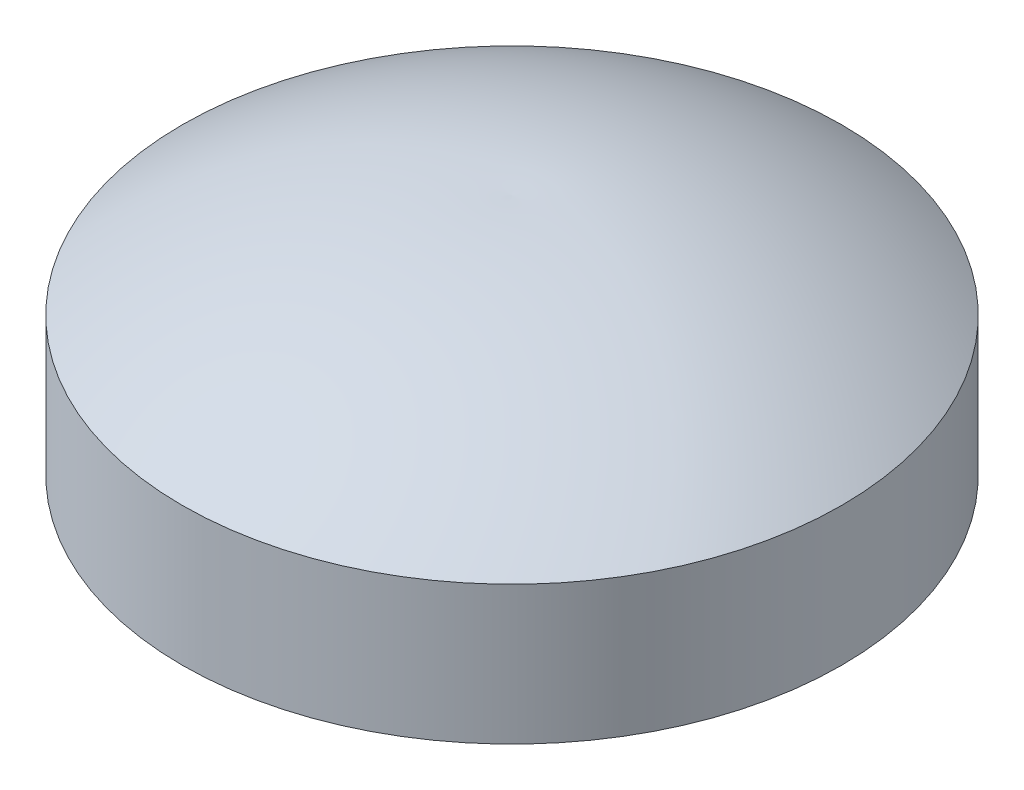
ISO-10303-21;
HEADER;
FILE_DESCRIPTION(('STEP AP214'),'2;1');
FILE_NAME('part.step','',(''),(''),'','','');
FILE_SCHEMA(('AUTOMOTIVE_DESIGN { 1 0 10303 214 1 1 1 1 }'));
ENDSEC;
DATA;
#1=APPLICATION_CONTEXT('core data for automotive mechanical design processes');
#2=APPLICATION_PROTOCOL_DEFINITION('international standard','automotive_design',2000,#1);
#3=PRODUCT_CONTEXT('',#1,'mechanical');
#4=PRODUCT('Part','Part','',(#3));
#5=PRODUCT_RELATED_PRODUCT_CATEGORY('part','',(#4));
#6=PRODUCT_DEFINITION_FORMATION('','',#4);
#7=PRODUCT_DEFINITION_CONTEXT('part definition',#1,'design');
#8=PRODUCT_DEFINITION('design','',#6,#7);
#9=PRODUCT_DEFINITION_SHAPE('','',#8);
#10=(LENGTH_UNIT() NAMED_UNIT(*) SI_UNIT(.MILLI.,.METRE.));
#11=(NAMED_UNIT(*) PLANE_ANGLE_UNIT() SI_UNIT($,.RADIAN.));
#12=(NAMED_UNIT(*) SI_UNIT($,.STERADIAN.) SOLID_ANGLE_UNIT());
#13=UNCERTAINTY_MEASURE_WITH_UNIT(LENGTH_MEASURE(1.E-05),#10,'distance_accuracy_value','');
#14=(GEOMETRIC_REPRESENTATION_CONTEXT(3) GLOBAL_UNCERTAINTY_ASSIGNED_CONTEXT((#13)) GLOBAL_UNIT_ASSIGNED_CONTEXT((#10,
#11,#12)) REPRESENTATION_CONTEXT('',''));
#15=CARTESIAN_POINT('',(0.,0.,0.));
#16=DIRECTION('',(0.,0.,1.));
#17=DIRECTION('',(1.,0.,0.));
#18=AXIS2_PLACEMENT_3D('',#15,#16,#17);
#19=CARTESIAN_POINT('',(0.,0.,0.));
#20=DIRECTION('',(0.,-1.,0.));
#21=DIRECTION('',(0.,0.,-1.));
#22=AXIS2_PLACEMENT_3D('',#19,#20,#21);
#23=PLANE('',#22);
#24=CARTESIAN_POINT('',(0.,0.,0.));
#25=DIRECTION('',(0.,-1.,0.));
#26=DIRECTION('',(0.,0.,-1.));
#27=AXIS2_PLACEMENT_3D('',#24,#25,#26);
#28=CIRCLE('',#27,4.7625);
#29=CARTESIAN_POINT('',(0.,0.,-4.7625));
#30=VERTEX_POINT('',#29);
#31=EDGE_CURVE('E11',#30,#30,#28,.T.);
#32=ORIENTED_EDGE('',*,*,#31,.T.);
#33=EDGE_LOOP('',(#32));
#34=FACE_BOUND('',#33,.T.);
#35=ADVANCED_FACE('F34',(#34),#23,.T.);
#36=CARTESIAN_POINT('',(0.,0.,0.));
#37=DIRECTION('',(0.,-1.,0.));
#38=DIRECTION('',(0.,0.,-1.));
#39=AXIS2_PLACEMENT_3D('',#36,#37,#38);
#40=CYLINDRICAL_SURFACE('',#39,4.7625);
#41=CARTESIAN_POINT('',(0.,2.,0.));
#42=DIRECTION('',(0.,-1.,0.));
#43=DIRECTION('',(0.,0.,-1.));
#44=AXIS2_PLACEMENT_3D('',#41,#42,#43);
#45=CIRCLE('',#44,4.7625);
#46=CARTESIAN_POINT('',(0.,2.,-4.7625));
#47=VERTEX_POINT('',#46);
#48=EDGE_CURVE('E40',#47,#47,#45,.T.);
#49=ORIENTED_EDGE('',*,*,#48,.T.);
#50=EDGE_LOOP('',(#49));
#51=FACE_BOUND('',#50,.T.);
#52=ORIENTED_EDGE('',*,*,#31,.F.);
#53=EDGE_LOOP('',(#52));
#54=FACE_BOUND('',#53,.T.);
#55=ADVANCED_FACE('F46',(#51,#54),#40,.T.);
#56=CARTESIAN_POINT('',(4.7625,2.,0.));
#57=CARTESIAN_POINT('',(2.47128412108364,3.60432663008302,0.));
#58=CARTESIAN_POINT('',(0.,3.5,0.));
#59=B_SPLINE_CURVE_WITH_KNOTS('',2,(#56,#57,#58),.UNSPECIFIED.,.F.,.F.,(3,3),(0.,1.),.UNSPECIFIED.);
#60=CARTESIAN_POINT('',(0.,0.,0.));
#61=DIRECTION('',(0.,-1.,0.));
#62=AXIS1_PLACEMENT('',#60,#61);
#63=SURFACE_OF_REVOLUTION('',#59,#62);
#64=CARTESIAN_POINT('',(0.,3.5,0.));
#65=VERTEX_POINT('',#64);
#66=VERTEX_LOOP('',#65);
#67=FACE_BOUND('',#66,.T.);
#68=ORIENTED_EDGE('',*,*,#48,.F.);
#69=EDGE_LOOP('',(#68));
#70=FACE_BOUND('',#69,.T.);
#71=ADVANCED_FACE('F43',(#67,#70),#63,.F.);
#72=CLOSED_SHELL('',(#35,#55,#71));
#73=MANIFOLD_SOLID_BREP('B2',#72);
#74=ADVANCED_BREP_SHAPE_REPRESENTATION('',(#18,#73),#14);
#75=SHAPE_DEFINITION_REPRESENTATION(#9,#74);
ENDSEC;
END-ISO-10303-21;
